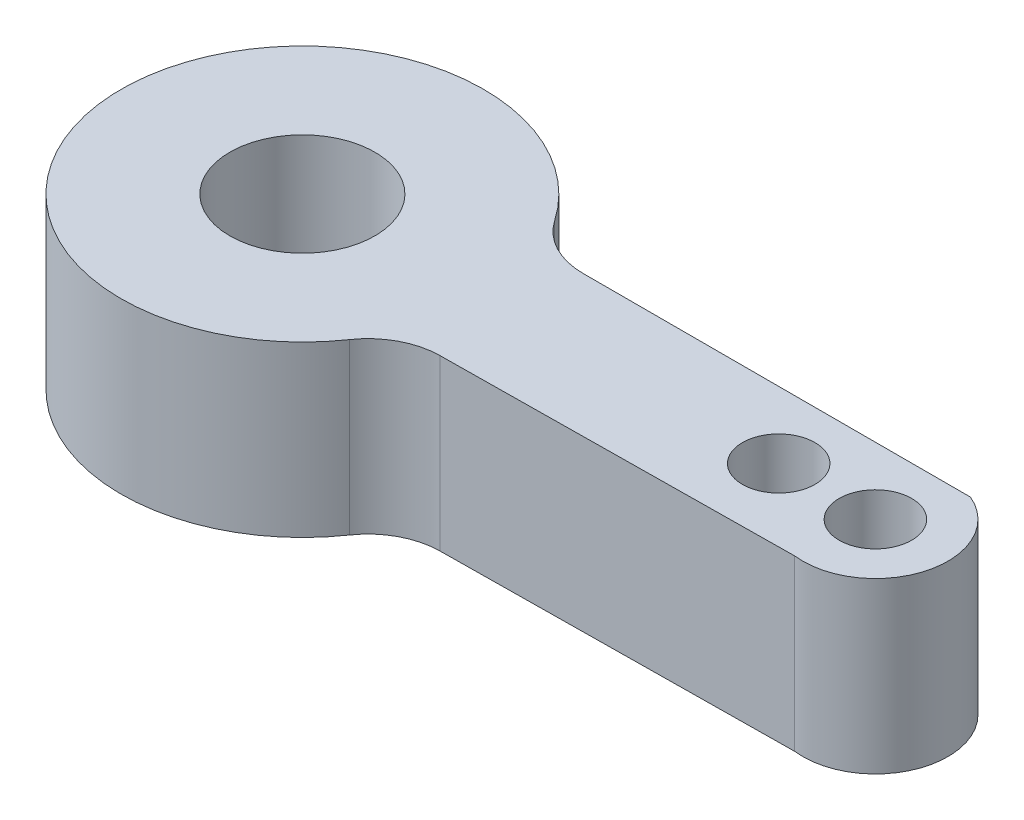
ISO-10303-21;
HEADER;
FILE_DESCRIPTION(('STEP AP214'),'2;1');
FILE_NAME('part.step','',(''),(''),'','','');
FILE_SCHEMA(('AUTOMOTIVE_DESIGN { 1 0 10303 214 1 1 1 1 }'));
ENDSEC;
DATA;
#1=APPLICATION_CONTEXT('core data for automotive mechanical design processes');
#2=APPLICATION_PROTOCOL_DEFINITION('international standard','automotive_design',2000,#1);
#3=PRODUCT_CONTEXT('',#1,'mechanical');
#4=PRODUCT('Part','Part','',(#3));
#5=PRODUCT_RELATED_PRODUCT_CATEGORY('part','',(#4));
#6=PRODUCT_DEFINITION_FORMATION('','',#4);
#7=PRODUCT_DEFINITION_CONTEXT('part definition',#1,'design');
#8=PRODUCT_DEFINITION('design','',#6,#7);
#9=PRODUCT_DEFINITION_SHAPE('','',#8);
#10=(LENGTH_UNIT() NAMED_UNIT(*) SI_UNIT(.MILLI.,.METRE.));
#11=(NAMED_UNIT(*) PLANE_ANGLE_UNIT() SI_UNIT($,.RADIAN.));
#12=(NAMED_UNIT(*) SI_UNIT($,.STERADIAN.) SOLID_ANGLE_UNIT());
#13=UNCERTAINTY_MEASURE_WITH_UNIT(LENGTH_MEASURE(1.E-05),#10,'distance_accuracy_value','');
#14=(GEOMETRIC_REPRESENTATION_CONTEXT(3) GLOBAL_UNCERTAINTY_ASSIGNED_CONTEXT((#13)) GLOBAL_UNIT_ASSIGNED_CONTEXT((#10,
#11,#12)) REPRESENTATION_CONTEXT('',''));
#15=CARTESIAN_POINT('',(0.,0.,0.));
#16=DIRECTION('',(0.,0.,1.));
#17=DIRECTION('',(1.,0.,0.));
#18=AXIS2_PLACEMENT_3D('',#15,#16,#17);
#19=CARTESIAN_POINT('',(0.,7.,0.));
#20=DIRECTION('',(0.,-1.,0.));
#21=DIRECTION('',(0.,0.,-1.));
#22=AXIS2_PLACEMENT_3D('',#19,#20,#21);
#23=PLANE('',#22);
#24=DIRECTION('',(-1.,0.,0.));
#25=VECTOR('',#24,1.);
#26=CARTESIAN_POINT('',(6.89102231975947,7.,-2.96037352180037));
#27=LINE('',#26,#25);
#28=CARTESIAN_POINT('',(24.6694144597538,7.,-2.96037352180037));
#29=VERTEX_POINT('',#28);
#30=CARTESIAN_POINT('',(8.64430144549697,7.,-2.96037352180037));
#31=VERTEX_POINT('',#30);
#32=EDGE_CURVE('E122',#29,#31,#27,.T.);
#33=ORIENTED_EDGE('',*,*,#32,.T.);
#34=CARTESIAN_POINT('',(8.64430144549697,7.,-5.96037352180037));
#35=DIRECTION('',(0.,-1.,0.));
#36=DIRECTION('',(0.,0.,-1.));
#37=AXIS2_PLACEMENT_3D('',#34,#35,#36);
#38=CIRCLE('',#37,3.);
#39=CARTESIAN_POINT('',(6.17450103249783,7.,-4.25740965842883));
#40=VERTEX_POINT('',#39);
#41=EDGE_CURVE('E11',#31,#40,#38,.T.);
#42=ORIENTED_EDGE('',*,*,#41,.T.);
#43=CARTESIAN_POINT('',(0.,7.,0.));
#44=DIRECTION('',(0.,1.,0.));
#45=DIRECTION('',(0.,0.,-1.));
#46=AXIS2_PLACEMENT_3D('',#43,#44,#45);
#47=CIRCLE('',#46,7.49999999999999);
#48=CARTESIAN_POINT('',(6.18399734642069,7.,4.24360422512064));
#49=VERTEX_POINT('',#48);
#50=EDGE_CURVE('E106',#40,#49,#47,.T.);
#51=ORIENTED_EDGE('',*,*,#50,.T.);
#52=CARTESIAN_POINT('',(8.65759628498897,7.,5.9410459151689));
#53=DIRECTION('',(0.,-1.,0.));
#54=DIRECTION('',(0.,0.,-1.));
#55=AXIS2_PLACEMENT_3D('',#52,#53,#54);
#56=CIRCLE('',#55,3.);
#57=CARTESIAN_POINT('',(8.62446541754517,7.,2.94122886314349));
#58=VERTEX_POINT('',#57);
#59=EDGE_CURVE('E101',#49,#58,#56,.T.);
#60=ORIENTED_EDGE('',*,*,#59,.T.);
#61=DIRECTION('',(0.999939017341803,0.,-0.0110436224812638));
#62=VECTOR('',#61,1.);
#63=CARTESIAN_POINT('',(6.89102231975947,7.,2.96037352180037));
#64=LINE('',#63,#62);
#65=CARTESIAN_POINT('',(23.1420853546382,7.,2.78089197146191));
#66=VERTEX_POINT('',#65);
#67=EDGE_CURVE('E93',#58,#66,#64,.T.);
#68=ORIENTED_EDGE('',*,*,#67,.T.);
#69=CARTESIAN_POINT('',(23.5,7.,-0.197681026910896));
#70=DIRECTION('',(0.,1.,0.));
#71=DIRECTION('',(0.,0.,-1.));
#72=AXIS2_PLACEMENT_3D('',#69,#70,#71);
#73=CIRCLE('',#72,3.);
#74=EDGE_CURVE('E97',#66,#29,#73,.T.);
#75=ORIENTED_EDGE('',*,*,#74,.T.);
#76=EDGE_LOOP('',(#33,#42,#51,#60,#68,#75));
#77=FACE_BOUND('',#76,.T.);
#78=CARTESIAN_POINT('',(23.5,7.,-0.197681026910896));
#79=DIRECTION('',(0.,1.,0.));
#80=DIRECTION('',(0.,0.,1.));
#81=AXIS2_PLACEMENT_3D('',#78,#79,#80);
#82=CIRCLE('',#81,1.5);
#83=CARTESIAN_POINT('',(23.5,7.,1.3023189730891));
#84=VERTEX_POINT('',#83);
#85=EDGE_CURVE('E132',#84,#84,#82,.T.);
#86=ORIENTED_EDGE('',*,*,#85,.F.);
#87=EDGE_LOOP('',(#86));
#88=FACE_BOUND('',#87,.T.);
#89=CARTESIAN_POINT('',(19.5,7.,-0.197681026910895));
#90=DIRECTION('',(0.,1.,0.));
#91=DIRECTION('',(0.,0.,1.));
#92=AXIS2_PLACEMENT_3D('',#89,#90,#91);
#93=CIRCLE('',#92,1.5);
#94=CARTESIAN_POINT('',(19.5,7.,1.30231897308911));
#95=VERTEX_POINT('',#94);
#96=EDGE_CURVE('E272',#95,#95,#93,.T.);
#97=ORIENTED_EDGE('',*,*,#96,.F.);
#98=EDGE_LOOP('',(#97));
#99=FACE_BOUND('',#98,.T.);
#100=CARTESIAN_POINT('',(0.,7.,0.));
#101=DIRECTION('',(0.,1.,0.));
#102=DIRECTION('',(0.,0.,1.));
#103=AXIS2_PLACEMENT_3D('',#100,#101,#102);
#104=CIRCLE('',#103,3.);
#105=CARTESIAN_POINT('',(0.,7.,3.));
#106=VERTEX_POINT('',#105);
#107=EDGE_CURVE('E277',#106,#106,#104,.T.);
#108=ORIENTED_EDGE('',*,*,#107,.F.);
#109=EDGE_LOOP('',(#108));
#110=FACE_BOUND('',#109,.T.);
#111=ADVANCED_FACE('F40',(#77,#88,#99,#110),#23,.F.);
#112=CARTESIAN_POINT('',(0.,0.,0.));
#113=DIRECTION('',(0.,-1.,0.));
#114=DIRECTION('',(0.,0.,-1.));
#115=AXIS2_PLACEMENT_3D('',#112,#113,#114);
#116=PLANE('',#115);
#117=CARTESIAN_POINT('',(19.5,0.,-0.197681026910895));
#118=DIRECTION('',(0.,1.,0.));
#119=DIRECTION('',(0.,0.,1.));
#120=AXIS2_PLACEMENT_3D('',#117,#118,#119);
#121=CIRCLE('',#120,1.5);
#122=CARTESIAN_POINT('',(19.5,0.,1.30231897308911));
#123=VERTEX_POINT('',#122);
#124=EDGE_CURVE('E275',#123,#123,#121,.T.);
#125=ORIENTED_EDGE('',*,*,#124,.T.);
#126=EDGE_LOOP('',(#125));
#127=FACE_BOUND('',#126,.T.);
#128=CARTESIAN_POINT('',(0.,0.,0.));
#129=DIRECTION('',(0.,1.,0.));
#130=DIRECTION('',(0.,0.,1.));
#131=AXIS2_PLACEMENT_3D('',#128,#129,#130);
#132=CIRCLE('',#131,7.49999999999999);
#133=CARTESIAN_POINT('',(6.17450103249783,0.,-4.25740965842883));
#134=VERTEX_POINT('',#133);
#135=CARTESIAN_POINT('',(6.18399734642069,0.,4.24360422512064));
#136=VERTEX_POINT('',#135);
#137=EDGE_CURVE('E128',#134,#136,#132,.T.);
#138=ORIENTED_EDGE('',*,*,#137,.F.);
#139=CARTESIAN_POINT('',(8.64430144549697,0.,-5.96037352180037));
#140=DIRECTION('',(0.,-1.,0.));
#141=DIRECTION('',(0.,0.,-1.));
#142=AXIS2_PLACEMENT_3D('',#139,#140,#141);
#143=CIRCLE('',#142,3.);
#144=CARTESIAN_POINT('',(8.64430144549697,0.,-2.96037352180037));
#145=VERTEX_POINT('',#144);
#146=EDGE_CURVE('E49',#134,#145,#143,.F.);
#147=ORIENTED_EDGE('',*,*,#146,.T.);
#148=DIRECTION('',(-1.,0.,0.));
#149=VECTOR('',#148,1.);
#150=CARTESIAN_POINT('',(6.89102231975947,0.,-2.96037352180037));
#151=LINE('',#150,#149);
#152=CARTESIAN_POINT('',(24.6694144597538,0.,-2.96037352180037));
#153=VERTEX_POINT('',#152);
#154=EDGE_CURVE('E138',#153,#145,#151,.T.);
#155=ORIENTED_EDGE('',*,*,#154,.F.);
#156=CARTESIAN_POINT('',(23.5,0.,-0.197681026910896));
#157=DIRECTION('',(0.,1.,0.));
#158=DIRECTION('',(0.,0.,-1.));
#159=AXIS2_PLACEMENT_3D('',#156,#157,#158);
#160=CIRCLE('',#159,3.);
#161=CARTESIAN_POINT('',(23.1420853546382,0.,2.78089197146191));
#162=VERTEX_POINT('',#161);
#163=EDGE_CURVE('E135',#162,#153,#160,.T.);
#164=ORIENTED_EDGE('',*,*,#163,.F.);
#165=DIRECTION('',(0.999939017341803,0.,-0.0110436224812638));
#166=VECTOR('',#165,1.);
#167=CARTESIAN_POINT('',(6.89102231975947,0.,2.96037352180037));
#168=LINE('',#167,#166);
#169=CARTESIAN_POINT('',(8.62446541754517,0.,2.94122886314349));
#170=VERTEX_POINT('',#169);
#171=EDGE_CURVE('E112',#170,#162,#168,.T.);
#172=ORIENTED_EDGE('',*,*,#171,.F.);
#173=CARTESIAN_POINT('',(8.65759628498897,0.,5.9410459151689));
#174=DIRECTION('',(0.,-1.,0.));
#175=DIRECTION('',(0.,0.,-1.));
#176=AXIS2_PLACEMENT_3D('',#173,#174,#175);
#177=CIRCLE('',#176,3.);
#178=EDGE_CURVE('E154',#170,#136,#177,.F.);
#179=ORIENTED_EDGE('',*,*,#178,.T.);
#180=EDGE_LOOP('',(#138,#147,#155,#164,#172,#179));
#181=FACE_BOUND('',#180,.T.);
#182=CARTESIAN_POINT('',(23.5,0.,-0.197681026910896));
#183=DIRECTION('',(0.,1.,0.));
#184=DIRECTION('',(0.,0.,1.));
#185=AXIS2_PLACEMENT_3D('',#182,#183,#184);
#186=CIRCLE('',#185,1.5);
#187=CARTESIAN_POINT('',(23.5,0.,1.3023189730891));
#188=VERTEX_POINT('',#187);
#189=EDGE_CURVE('E281',#188,#188,#186,.T.);
#190=ORIENTED_EDGE('',*,*,#189,.T.);
#191=EDGE_LOOP('',(#190));
#192=FACE_BOUND('',#191,.T.);
#193=CARTESIAN_POINT('',(0.,0.,0.));
#194=DIRECTION('',(0.,1.,0.));
#195=DIRECTION('',(0.,0.,1.));
#196=AXIS2_PLACEMENT_3D('',#193,#194,#195);
#197=CIRCLE('',#196,3.);
#198=CARTESIAN_POINT('',(0.,0.,3.));
#199=VERTEX_POINT('',#198);
#200=EDGE_CURVE('E284',#199,#199,#197,.T.);
#201=ORIENTED_EDGE('',*,*,#200,.T.);
#202=EDGE_LOOP('',(#201));
#203=FACE_BOUND('',#202,.T.);
#204=ADVANCED_FACE('F159',(#127,#181,#192,#203),#116,.T.);
#205=CARTESIAN_POINT('',(0.,7.,0.));
#206=DIRECTION('',(0.,-1.,0.));
#207=DIRECTION('',(0.,0.,-1.));
#208=AXIS2_PLACEMENT_3D('',#205,#206,#207);
#209=CYLINDRICAL_SURFACE('',#208,7.49999999999999);
#210=ORIENTED_EDGE('',*,*,#137,.T.);
#211=DIRECTION('',(0.,-1.,0.));
#212=VECTOR('',#211,1.);
#213=CARTESIAN_POINT('',(6.18399734642069,7.,4.24360422512064));
#214=LINE('',#213,#212);
#215=EDGE_CURVE('E149',#136,#49,#214,.F.);
#216=ORIENTED_EDGE('',*,*,#215,.T.);
#217=ORIENTED_EDGE('',*,*,#50,.F.);
#218=DIRECTION('',(0.,-1.,0.));
#219=VECTOR('',#218,1.);
#220=CARTESIAN_POINT('',(6.17450103249783,7.,-4.25740965842883));
#221=LINE('',#220,#219);
#222=EDGE_CURVE('E145',#40,#134,#221,.T.);
#223=ORIENTED_EDGE('',*,*,#222,.T.);
#224=EDGE_LOOP('',(#210,#216,#217,#223));
#225=FACE_BOUND('',#224,.T.);
#226=ADVANCED_FACE('F164',(#225),#209,.T.);
#227=CARTESIAN_POINT('',(6.89102231975947,7.,2.96037352180037));
#228=DIRECTION('',(-0.0110436224812638,0.,-0.999939017341803));
#229=DIRECTION('',(-0.999939017341803,0.,0.0110436224812638));
#230=AXIS2_PLACEMENT_3D('',#227,#228,#229);
#231=PLANE('',#230);
#232=ORIENTED_EDGE('',*,*,#67,.F.);
#233=DIRECTION('',(0.,1.,0.));
#234=VECTOR('',#233,1.);
#235=CARTESIAN_POINT('',(8.62446541754517,0.,2.94122886314349));
#236=LINE('',#235,#234);
#237=EDGE_CURVE('E116',#58,#170,#236,.F.);
#238=ORIENTED_EDGE('',*,*,#237,.T.);
#239=ORIENTED_EDGE('',*,*,#171,.T.);
#240=DIRECTION('',(0.,-1.,0.));
#241=VECTOR('',#240,1.);
#242=CARTESIAN_POINT('',(23.1420853546382,7.,2.78089197146191));
#243=LINE('',#242,#241);
#244=EDGE_CURVE('E109',#66,#162,#243,.T.);
#245=ORIENTED_EDGE('',*,*,#244,.F.);
#246=EDGE_LOOP('',(#232,#238,#239,#245));
#247=FACE_BOUND('',#246,.T.);
#248=ADVANCED_FACE('F110',(#247),#231,.F.);
#249=CARTESIAN_POINT('',(23.5,7.,-0.197681026910896));
#250=DIRECTION('',(0.,-1.,0.));
#251=DIRECTION('',(0.,0.,-1.));
#252=AXIS2_PLACEMENT_3D('',#249,#250,#251);
#253=CYLINDRICAL_SURFACE('',#252,3.);
#254=ORIENTED_EDGE('',*,*,#163,.T.);
#255=DIRECTION('',(0.,-1.,0.));
#256=VECTOR('',#255,1.);
#257=CARTESIAN_POINT('',(24.6694144597538,7.,-2.96037352180037));
#258=LINE('',#257,#256);
#259=EDGE_CURVE('E117',#29,#153,#258,.T.);
#260=ORIENTED_EDGE('',*,*,#259,.F.);
#261=ORIENTED_EDGE('',*,*,#74,.F.);
#262=ORIENTED_EDGE('',*,*,#244,.T.);
#263=EDGE_LOOP('',(#254,#260,#261,#262));
#264=FACE_BOUND('',#263,.T.);
#265=ADVANCED_FACE('F119',(#264),#253,.T.);
#266=CARTESIAN_POINT('',(6.89102231975947,7.,-2.96037352180037));
#267=DIRECTION('',(0.,0.,1.));
#268=DIRECTION('',(1.,0.,0.));
#269=AXIS2_PLACEMENT_3D('',#266,#267,#268);
#270=PLANE('',#269);
#271=ORIENTED_EDGE('',*,*,#154,.T.);
#272=DIRECTION('',(0.,1.,0.));
#273=VECTOR('',#272,1.);
#274=CARTESIAN_POINT('',(8.64430144549697,7.,-2.96037352180037));
#275=LINE('',#274,#273);
#276=EDGE_CURVE('E56',#145,#31,#275,.T.);
#277=ORIENTED_EDGE('',*,*,#276,.T.);
#278=ORIENTED_EDGE('',*,*,#32,.F.);
#279=ORIENTED_EDGE('',*,*,#259,.T.);
#280=EDGE_LOOP('',(#271,#277,#278,#279));
#281=FACE_BOUND('',#280,.T.);
#282=ADVANCED_FACE('F190',(#281),#270,.F.);
#283=CARTESIAN_POINT('',(23.5,7.,-0.197681026910896));
#284=DIRECTION('',(0.,-1.,0.));
#285=DIRECTION('',(0.,0.,-1.));
#286=AXIS2_PLACEMENT_3D('',#283,#284,#285);
#287=CYLINDRICAL_SURFACE('',#286,1.5);
#288=ORIENTED_EDGE('',*,*,#85,.T.);
#289=EDGE_LOOP('',(#288));
#290=FACE_BOUND('',#289,.T.);
#291=ORIENTED_EDGE('',*,*,#189,.F.);
#292=EDGE_LOOP('',(#291));
#293=FACE_BOUND('',#292,.T.);
#294=ADVANCED_FACE('F187',(#290,#293),#287,.F.);
#295=CARTESIAN_POINT('',(19.5,7.,-0.197681026910895));
#296=DIRECTION('',(0.,-1.,0.));
#297=DIRECTION('',(0.,0.,-1.));
#298=AXIS2_PLACEMENT_3D('',#295,#296,#297);
#299=CYLINDRICAL_SURFACE('',#298,1.5);
#300=ORIENTED_EDGE('',*,*,#96,.T.);
#301=EDGE_LOOP('',(#300));
#302=FACE_BOUND('',#301,.T.);
#303=ORIENTED_EDGE('',*,*,#124,.F.);
#304=EDGE_LOOP('',(#303));
#305=FACE_BOUND('',#304,.T.);
#306=ADVANCED_FACE('F175',(#302,#305),#299,.F.);
#307=CARTESIAN_POINT('',(0.,7.,0.));
#308=DIRECTION('',(0.,-1.,0.));
#309=DIRECTION('',(0.,0.,-1.));
#310=AXIS2_PLACEMENT_3D('',#307,#308,#309);
#311=CYLINDRICAL_SURFACE('',#310,3.);
#312=ORIENTED_EDGE('',*,*,#107,.T.);
#313=EDGE_LOOP('',(#312));
#314=FACE_BOUND('',#313,.T.);
#315=ORIENTED_EDGE('',*,*,#200,.F.);
#316=EDGE_LOOP('',(#315));
#317=FACE_BOUND('',#316,.T.);
#318=ADVANCED_FACE('F169',(#314,#317),#311,.F.);
#319=CARTESIAN_POINT('',(8.65759628498897,7.,5.9410459151689));
#320=DIRECTION('',(0.,-1.,0.));
#321=DIRECTION('',(0.,0.,-1.));
#322=AXIS2_PLACEMENT_3D('',#319,#320,#321);
#323=CYLINDRICAL_SURFACE('',#322,3.);
#324=ORIENTED_EDGE('',*,*,#59,.F.);
#325=ORIENTED_EDGE('',*,*,#215,.F.);
#326=ORIENTED_EDGE('',*,*,#178,.F.);
#327=ORIENTED_EDGE('',*,*,#237,.F.);
#328=EDGE_LOOP('',(#324,#325,#326,#327));
#329=FACE_BOUND('',#328,.T.);
#330=ADVANCED_FACE('F167',(#329),#323,.F.);
#331=CARTESIAN_POINT('',(8.64430144549697,7.,-5.96037352180037));
#332=DIRECTION('',(0.,-1.,0.));
#333=DIRECTION('',(0.,0.,-1.));
#334=AXIS2_PLACEMENT_3D('',#331,#332,#333);
#335=CYLINDRICAL_SURFACE('',#334,3.);
#336=ORIENTED_EDGE('',*,*,#41,.F.);
#337=ORIENTED_EDGE('',*,*,#276,.F.);
#338=ORIENTED_EDGE('',*,*,#146,.F.);
#339=ORIENTED_EDGE('',*,*,#222,.F.);
#340=EDGE_LOOP('',(#336,#337,#338,#339));
#341=FACE_BOUND('',#340,.T.);
#342=ADVANCED_FACE('F42',(#341),#335,.F.);
#343=CLOSED_SHELL('',(#111,#204,#226,#248,#265,#282,#294,#306,#318,#330,#342));
#344=MANIFOLD_SOLID_BREP('B2',#343);
#345=ADVANCED_BREP_SHAPE_REPRESENTATION('',(#18,#344),#14);
#346=SHAPE_DEFINITION_REPRESENTATION(#9,#345);
ENDSEC;
END-ISO-10303-21;
